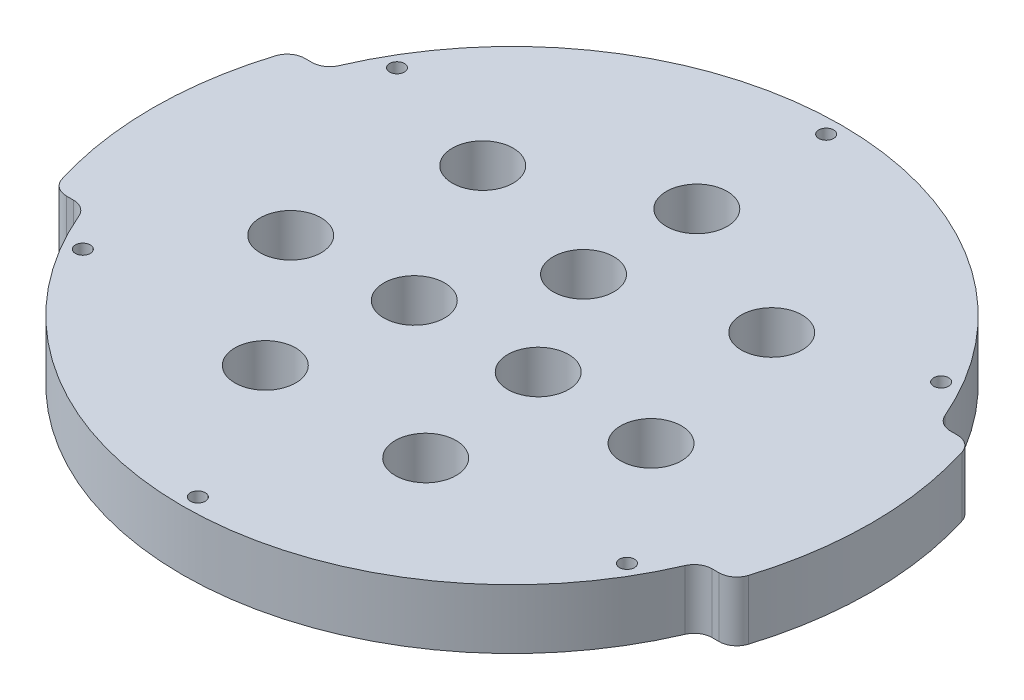
ISO-10303-21;
HEADER;
FILE_DESCRIPTION(('STEP AP214'),'2;1');
FILE_NAME('part.step','',(''),(''),'','','');
FILE_SCHEMA(('AUTOMOTIVE_DESIGN { 1 0 10303 214 1 1 1 1 }'));
ENDSEC;
DATA;
#1=APPLICATION_CONTEXT('core data for automotive mechanical design processes');
#2=APPLICATION_PROTOCOL_DEFINITION('international standard','automotive_design',2000,#1);
#3=PRODUCT_CONTEXT('',#1,'mechanical');
#4=PRODUCT('Part','Part','',(#3));
#5=PRODUCT_RELATED_PRODUCT_CATEGORY('part','',(#4));
#6=PRODUCT_DEFINITION_FORMATION('','',#4);
#7=PRODUCT_DEFINITION_CONTEXT('part definition',#1,'design');
#8=PRODUCT_DEFINITION('design','',#6,#7);
#9=PRODUCT_DEFINITION_SHAPE('','',#8);
#10=(LENGTH_UNIT() NAMED_UNIT(*) SI_UNIT(.MILLI.,.METRE.));
#11=(NAMED_UNIT(*) PLANE_ANGLE_UNIT() SI_UNIT($,.RADIAN.));
#12=(NAMED_UNIT(*) SI_UNIT($,.STERADIAN.) SOLID_ANGLE_UNIT());
#13=UNCERTAINTY_MEASURE_WITH_UNIT(LENGTH_MEASURE(1.E-05),#10,'distance_accuracy_value','');
#14=(GEOMETRIC_REPRESENTATION_CONTEXT(3) GLOBAL_UNCERTAINTY_ASSIGNED_CONTEXT((#13)) GLOBAL_UNIT_ASSIGNED_CONTEXT((#10,
#11,#12)) REPRESENTATION_CONTEXT('',''));
#15=CARTESIAN_POINT('',(0.,0.,0.));
#16=DIRECTION('',(0.,0.,1.));
#17=DIRECTION('',(1.,0.,0.));
#18=AXIS2_PLACEMENT_3D('',#15,#16,#17);
#19=CARTESIAN_POINT('',(0.,10.,0.));
#20=DIRECTION('',(0.,-1.,0.));
#21=DIRECTION('',(0.,0.,-1.));
#22=AXIS2_PLACEMENT_3D('',#19,#20,#21);
#23=CYLINDRICAL_SURFACE('',#22,60.3);
#24=CARTESIAN_POINT('',(0.,0.,0.));
#25=DIRECTION('',(0.,1.,0.));
#26=DIRECTION('',(0.,0.,1.));
#27=AXIS2_PLACEMENT_3D('',#24,#25,#26);
#28=CIRCLE('',#27,60.3);
#29=CARTESIAN_POINT('',(57.5850330094447,0.,17.8900523560209));
#30=VERTEX_POINT('',#29);
#31=CARTESIAN_POINT('',(57.5850330094447,0.,-17.8900523560209));
#32=VERTEX_POINT('',#31);
#33=EDGE_CURVE('E189',#30,#32,#28,.T.);
#34=ORIENTED_EDGE('',*,*,#33,.T.);
#35=DIRECTION('',(0.,-1.,0.));
#36=VECTOR('',#35,1.);
#37=CARTESIAN_POINT('',(57.5850330094447,10.,-17.8900523560209));
#38=LINE('',#37,#36);
#39=CARTESIAN_POINT('',(57.5850330094447,10.,-17.8900523560209));
#40=VERTEX_POINT('',#39);
#41=EDGE_CURVE('E196',#32,#40,#38,.F.);
#42=ORIENTED_EDGE('',*,*,#41,.T.);
#43=CARTESIAN_POINT('',(0.,10.,0.));
#44=DIRECTION('',(0.,1.,0.));
#45=DIRECTION('',(0.,0.,1.));
#46=AXIS2_PLACEMENT_3D('',#43,#44,#45);
#47=CIRCLE('',#46,60.3);
#48=CARTESIAN_POINT('',(57.5850330094447,10.,17.8900523560209));
#49=VERTEX_POINT('',#48);
#50=EDGE_CURVE('E185',#49,#40,#47,.T.);
#51=ORIENTED_EDGE('',*,*,#50,.F.);
#52=DIRECTION('',(0.,-1.,0.));
#53=VECTOR('',#52,1.);
#54=CARTESIAN_POINT('',(57.5850330094447,10.,17.8900523560209));
#55=LINE('',#54,#53);
#56=EDGE_CURVE('E194',#49,#30,#55,.T.);
#57=ORIENTED_EDGE('',*,*,#56,.T.);
#58=EDGE_LOOP('',(#34,#42,#51,#57));
#59=FACE_BOUND('',#58,.T.);
#60=ADVANCED_FACE('F32',(#59),#23,.T.);
#61=CARTESIAN_POINT('',(-57.5850330094447,0.,-17.8900523560209));
#62=VERTEX_POINT('',#61);
#63=CARTESIAN_POINT('',(-57.5850330094446,0.,17.890052356021));
#64=VERTEX_POINT('',#63);
#65=EDGE_CURVE('E186',#62,#64,#28,.T.);
#66=ORIENTED_EDGE('',*,*,#65,.T.);
#67=DIRECTION('',(0.,-1.,0.));
#68=VECTOR('',#67,1.);
#69=CARTESIAN_POINT('',(-57.5850330094447,10.,17.890052356021));
#70=LINE('',#69,#68);
#71=CARTESIAN_POINT('',(-57.5850330094446,10.,17.890052356021));
#72=VERTEX_POINT('',#71);
#73=EDGE_CURVE('E230',#64,#72,#70,.F.);
#74=ORIENTED_EDGE('',*,*,#73,.T.);
#75=CARTESIAN_POINT('',(-57.5850330094447,10.,-17.8900523560209));
#76=VERTEX_POINT('',#75);
#77=EDGE_CURVE('E182',#76,#72,#47,.T.);
#78=ORIENTED_EDGE('',*,*,#77,.F.);
#79=DIRECTION('',(0.,-1.,0.));
#80=VECTOR('',#79,1.);
#81=CARTESIAN_POINT('',(-57.5850330094447,10.,-17.8900523560209));
#82=LINE('',#81,#80);
#83=EDGE_CURVE('E228',#76,#62,#82,.T.);
#84=ORIENTED_EDGE('',*,*,#83,.T.);
#85=EDGE_LOOP('',(#66,#74,#78,#84));
#86=FACE_BOUND('',#85,.T.);
#87=ADVANCED_FACE('F284',(#86),#23,.T.);
#88=CARTESIAN_POINT('',(0.,10.,0.));
#89=DIRECTION('',(0.,1.,0.));
#90=DIRECTION('',(0.,0.,1.));
#91=AXIS2_PLACEMENT_3D('',#88,#89,#90);
#92=PLANE('',#91);
#93=CARTESIAN_POINT('',(-10.3923048454128,10.,6.0000000000003));
#94=DIRECTION('',(0.,1.,0.));
#95=DIRECTION('',(0.,0.,1.));
#96=AXIS2_PLACEMENT_3D('',#93,#94,#95);
#97=CIRCLE('',#96,5.10000000000068);
#98=CARTESIAN_POINT('',(-10.3923048454128,10.,11.100000000001));
#99=VERTEX_POINT('',#98);
#100=EDGE_CURVE('E385',#99,#99,#97,.T.);
#101=ORIENTED_EDGE('',*,*,#100,.F.);
#102=EDGE_LOOP('',(#101));
#103=FACE_BOUND('',#102,.T.);
#104=CARTESIAN_POINT('',(10.3923048454138,10.,5.9999999999997));
#105=DIRECTION('',(0.,1.,0.));
#106=DIRECTION('',(0.,0.,1.));
#107=AXIS2_PLACEMENT_3D('',#104,#105,#106);
#108=CIRCLE('',#107,5.10000000000047);
#109=CARTESIAN_POINT('',(10.3923048454138,10.,11.1000000000002));
#110=VERTEX_POINT('',#109);
#111=EDGE_CURVE('E387',#110,#110,#108,.T.);
#112=ORIENTED_EDGE('',*,*,#111,.F.);
#113=EDGE_LOOP('',(#112));
#114=FACE_BOUND('',#113,.T.);
#115=CARTESIAN_POINT('',(0.,10.,-12.));
#116=DIRECTION('',(0.,1.,0.));
#117=DIRECTION('',(0.,0.,1.));
#118=AXIS2_PLACEMENT_3D('',#115,#116,#117);
#119=CIRCLE('',#118,5.1);
#120=CARTESIAN_POINT('',(0.,10.,-6.9));
#121=VERTEX_POINT('',#120);
#122=EDGE_CURVE('E393',#121,#121,#119,.T.);
#123=ORIENTED_EDGE('',*,*,#122,.F.);
#124=EDGE_LOOP('',(#123));
#125=FACE_BOUND('',#124,.T.);
#126=CARTESIAN_POINT('',(-24.2367759565083,10.,-19.3281838576194));
#127=DIRECTION('',(0.,1.,0.));
#128=DIRECTION('',(0.,0.,1.));
#129=AXIS2_PLACEMENT_3D('',#126,#127,#128);
#130=CIRCLE('',#129,5.10000000000141);
#131=CARTESIAN_POINT('',(-24.2367759565083,10.,-14.228183857618));
#132=VERTEX_POINT('',#131);
#133=EDGE_CURVE('E399',#132,#132,#130,.T.);
#134=ORIENTED_EDGE('',*,*,#133,.F.);
#135=EDGE_LOOP('',(#134));
#136=FACE_BOUND('',#135,.T.);
#137=CARTESIAN_POINT('',(-30.2227652776344,10.,6.89814895264746));
#138=DIRECTION('',(0.,1.,0.));
#139=DIRECTION('',(0.,0.,1.));
#140=AXIS2_PLACEMENT_3D('',#137,#138,#139);
#141=CIRCLE('',#140,5.10000000000284);
#142=CARTESIAN_POINT('',(-30.2227652776344,10.,11.9981489526503));
#143=VERTEX_POINT('',#142);
#144=EDGE_CURVE('E405',#143,#143,#141,.T.);
#145=ORIENTED_EDGE('',*,*,#144,.F.);
#146=EDGE_LOOP('',(#145));
#147=FACE_BOUND('',#146,.T.);
#148=CARTESIAN_POINT('',(-13.450395912641,10.,27.9300349049758));
#149=DIRECTION('',(0.,1.,0.));
#150=DIRECTION('',(0.,0.,1.));
#151=AXIS2_PLACEMENT_3D('',#148,#149,#150);
#152=CIRCLE('',#151,5.10000000000365);
#153=CARTESIAN_POINT('',(-13.450395912641,10.,33.0300349049794));
#154=VERTEX_POINT('',#153);
#155=EDGE_CURVE('E411',#154,#154,#152,.T.);
#156=ORIENTED_EDGE('',*,*,#155,.F.);
#157=EDGE_LOOP('',(#156));
#158=FACE_BOUND('',#157,.T.);
#159=CARTESIAN_POINT('',(13.4503959126476,10.,27.9300349049742));
#160=DIRECTION('',(0.,1.,0.));
#161=DIRECTION('',(0.,0.,1.));
#162=AXIS2_PLACEMENT_3D('',#159,#160,#161);
#163=CIRCLE('',#162,5.10000000000316);
#164=CARTESIAN_POINT('',(13.4503959126476,10.,33.0300349049774));
#165=VERTEX_POINT('',#164);
#166=EDGE_CURVE('E417',#165,#165,#163,.T.);
#167=ORIENTED_EDGE('',*,*,#166,.F.);
#168=EDGE_LOOP('',(#167));
#169=FACE_BOUND('',#168,.T.);
#170=CARTESIAN_POINT('',(30.2227652776387,10.,6.89814895264403));
#171=DIRECTION('',(0.,1.,0.));
#172=DIRECTION('',(0.,0.,1.));
#173=AXIS2_PLACEMENT_3D('',#170,#171,#172);
#174=CIRCLE('',#173,5.10000000000167);
#175=CARTESIAN_POINT('',(30.2227652776387,10.,11.9981489526457));
#176=VERTEX_POINT('',#175);
#177=EDGE_CURVE('E423',#176,#176,#174,.T.);
#178=ORIENTED_EDGE('',*,*,#177,.F.);
#179=EDGE_LOOP('',(#178));
#180=FACE_BOUND('',#179,.T.);
#181=CARTESIAN_POINT('',(24.2367759565096,10.,-19.3281838576221));
#182=DIRECTION('',(0.,1.,0.));
#183=DIRECTION('',(0.,0.,1.));
#184=AXIS2_PLACEMENT_3D('',#181,#182,#183);
#185=CIRCLE('',#184,5.10000000000029);
#186=CARTESIAN_POINT('',(24.2367759565096,10.,-14.2281838576218));
#187=VERTEX_POINT('',#186);
#188=EDGE_CURVE('E429',#187,#187,#185,.T.);
#189=ORIENTED_EDGE('',*,*,#188,.F.);
#190=EDGE_LOOP('',(#189));
#191=FACE_BOUND('',#190,.T.);
#192=CARTESIAN_POINT('',(0.,10.,-31.));
#193=DIRECTION('',(0.,1.,0.));
#194=DIRECTION('',(0.,0.,1.));
#195=AXIS2_PLACEMENT_3D('',#192,#193,#194);
#196=CIRCLE('',#195,5.1);
#197=CARTESIAN_POINT('',(0.,10.,-25.9));
#198=VERTEX_POINT('',#197);
#199=EDGE_CURVE('E435',#198,#198,#196,.T.);
#200=ORIENTED_EDGE('',*,*,#199,.F.);
#201=EDGE_LOOP('',(#200));
#202=FACE_BOUND('',#201,.T.);
#203=CARTESIAN_POINT('',(45.6395387794396,10.,-26.3500000000005));
#204=DIRECTION('',(0.,-1.,0.));
#205=DIRECTION('',(0.,0.,-1.));
#206=AXIS2_PLACEMENT_3D('',#203,#204,#205);
#207=CIRCLE('',#206,1.25);
#208=CARTESIAN_POINT('',(45.6395387794396,10.,-27.6000000000005));
#209=VERTEX_POINT('',#208);
#210=EDGE_CURVE('E444',#209,#209,#207,.T.);
#211=ORIENTED_EDGE('',*,*,#210,.T.);
#212=EDGE_LOOP('',(#211));
#213=FACE_BOUND('',#212,.T.);
#214=CARTESIAN_POINT('',(45.6395387794402,10.,26.3499999999996));
#215=DIRECTION('',(0.,-1.,0.));
#216=DIRECTION('',(0.,0.,-1.));
#217=AXIS2_PLACEMENT_3D('',#214,#215,#216);
#218=CIRCLE('',#217,1.25);
#219=CARTESIAN_POINT('',(45.6395387794402,10.,25.0999999999996));
#220=VERTEX_POINT('',#219);
#221=EDGE_CURVE('E450',#220,#220,#218,.T.);
#222=ORIENTED_EDGE('',*,*,#221,.T.);
#223=EDGE_LOOP('',(#222));
#224=FACE_BOUND('',#223,.T.);
#225=CARTESIAN_POINT('',(3.68002133114066E-13,10.,52.7));
#226=DIRECTION('',(0.,-1.,0.));
#227=DIRECTION('',(0.,0.,-1.));
#228=AXIS2_PLACEMENT_3D('',#225,#226,#227);
#229=CIRCLE('',#228,1.25);
#230=CARTESIAN_POINT('',(3.68002133114066E-13,10.,51.45));
#231=VERTEX_POINT('',#230);
#232=EDGE_CURVE('E456',#231,#231,#229,.T.);
#233=ORIENTED_EDGE('',*,*,#232,.T.);
#234=EDGE_LOOP('',(#233));
#235=FACE_BOUND('',#234,.T.);
#236=CARTESIAN_POINT('',(-45.6395387794398,10.,26.3500000000002));
#237=DIRECTION('',(0.,-1.,0.));
#238=DIRECTION('',(0.,0.,-1.));
#239=AXIS2_PLACEMENT_3D('',#236,#237,#238);
#240=CIRCLE('',#239,1.25);
#241=CARTESIAN_POINT('',(-45.6395387794398,10.,25.1000000000002));
#242=VERTEX_POINT('',#241);
#243=EDGE_CURVE('E462',#242,#242,#240,.T.);
#244=ORIENTED_EDGE('',*,*,#243,.T.);
#245=EDGE_LOOP('',(#244));
#246=FACE_BOUND('',#245,.T.);
#247=CARTESIAN_POINT('',(-45.63953877944,10.,-26.3499999999999));
#248=DIRECTION('',(0.,-1.,0.));
#249=DIRECTION('',(0.,0.,-1.));
#250=AXIS2_PLACEMENT_3D('',#247,#248,#249);
#251=CIRCLE('',#250,1.25);
#252=CARTESIAN_POINT('',(-45.63953877944,10.,-27.5999999999999));
#253=VERTEX_POINT('',#252);
#254=EDGE_CURVE('E468',#253,#253,#251,.T.);
#255=ORIENTED_EDGE('',*,*,#254,.T.);
#256=EDGE_LOOP('',(#255));
#257=FACE_BOUND('',#256,.T.);
#258=CARTESIAN_POINT('',(0.,10.,-52.7));
#259=DIRECTION('',(0.,-1.,0.));
#260=DIRECTION('',(0.,0.,-1.));
#261=AXIS2_PLACEMENT_3D('',#258,#259,#260);
#262=CIRCLE('',#261,1.25);
#263=CARTESIAN_POINT('',(0.,10.,-53.95));
#264=VERTEX_POINT('',#263);
#265=EDGE_CURVE('E474',#264,#264,#262,.T.);
#266=ORIENTED_EDGE('',*,*,#265,.T.);
#267=EDGE_LOOP('',(#266));
#268=FACE_BOUND('',#267,.T.);
#269=ORIENTED_EDGE('',*,*,#50,.T.);
#270=CARTESIAN_POINT('',(54.7201059940494,10.,-17.));
#271=DIRECTION('',(0.,1.,0.));
#272=DIRECTION('',(0.,0.,1.));
#273=AXIS2_PLACEMENT_3D('',#270,#271,#272);
#274=CIRCLE('',#273,3.);
#275=CARTESIAN_POINT('',(54.7201059940494,10.,-20.));
#276=VERTEX_POINT('',#275);
#277=EDGE_CURVE('E172',#40,#276,#274,.T.);
#278=ORIENTED_EDGE('',*,*,#277,.T.);
#279=DIRECTION('',(1.,0.,0.));
#280=VECTOR('',#279,1.);
#281=CARTESIAN_POINT('',(51.5566678519859,10.,-20.));
#282=LINE('',#281,#280);
#283=CARTESIAN_POINT('',(53.5713542856628,10.,-20.));
#284=VERTEX_POINT('',#283);
#285=EDGE_CURVE('E163',#284,#276,#282,.T.);
#286=ORIENTED_EDGE('',*,*,#285,.F.);
#287=CARTESIAN_POINT('',(53.5713542856628,10.,-23.));
#288=DIRECTION('',(0.,1.,0.));
#289=DIRECTION('',(0.,0.,1.));
#290=AXIS2_PLACEMENT_3D('',#287,#288,#289);
#291=CIRCLE('',#290,3.);
#292=CARTESIAN_POINT('',(50.8146808232788,10.,-21.8164665523156));
#293=VERTEX_POINT('',#292);
#294=EDGE_CURVE('E146',#284,#293,#291,.F.);
#295=ORIENTED_EDGE('',*,*,#294,.T.);
#296=CARTESIAN_POINT('',(0.,10.,0.));
#297=DIRECTION('',(0.,-1.,0.));
#298=DIRECTION('',(0.,0.,1.));
#299=AXIS2_PLACEMENT_3D('',#296,#297,#298);
#300=CIRCLE('',#299,55.3);
#301=CARTESIAN_POINT('',(-50.8146808232788,10.,-21.8164665523156));
#302=VERTEX_POINT('',#301);
#303=EDGE_CURVE('E174',#302,#293,#300,.T.);
#304=ORIENTED_EDGE('',*,*,#303,.F.);
#305=CARTESIAN_POINT('',(-53.5713542856628,10.,-23.));
#306=DIRECTION('',(0.,1.,0.));
#307=DIRECTION('',(0.,0.,1.));
#308=AXIS2_PLACEMENT_3D('',#305,#306,#307);
#309=CIRCLE('',#308,3.);
#310=CARTESIAN_POINT('',(-53.5713542856628,10.,-20.));
#311=VERTEX_POINT('',#310);
#312=EDGE_CURVE('E40',#302,#311,#309,.F.);
#313=ORIENTED_EDGE('',*,*,#312,.T.);
#314=DIRECTION('',(1.,0.,0.));
#315=VECTOR('',#314,1.);
#316=CARTESIAN_POINT('',(-51.5566678519859,10.,-20.));
#317=LINE('',#316,#315);
#318=CARTESIAN_POINT('',(-54.7201059940494,10.,-20.));
#319=VERTEX_POINT('',#318);
#320=EDGE_CURVE('E173',#319,#311,#317,.T.);
#321=ORIENTED_EDGE('',*,*,#320,.F.);
#322=CARTESIAN_POINT('',(-54.7201059940494,10.,-17.));
#323=DIRECTION('',(0.,1.,0.));
#324=DIRECTION('',(0.,0.,1.));
#325=AXIS2_PLACEMENT_3D('',#322,#323,#324);
#326=CIRCLE('',#325,3.);
#327=EDGE_CURVE('E199',#319,#76,#326,.T.);
#328=ORIENTED_EDGE('',*,*,#327,.T.);
#329=ORIENTED_EDGE('',*,*,#77,.T.);
#330=CARTESIAN_POINT('',(-54.7201059940494,10.,17.));
#331=DIRECTION('',(0.,1.,0.));
#332=DIRECTION('',(0.,0.,1.));
#333=AXIS2_PLACEMENT_3D('',#330,#331,#332);
#334=CIRCLE('',#333,3.);
#335=CARTESIAN_POINT('',(-54.7201059940494,10.,20.));
#336=VERTEX_POINT('',#335);
#337=EDGE_CURVE('E201',#72,#336,#334,.T.);
#338=ORIENTED_EDGE('',*,*,#337,.T.);
#339=DIRECTION('',(-1.,0.,0.));
#340=VECTOR('',#339,1.);
#341=CARTESIAN_POINT('',(-56.8866416656846,10.,20.));
#342=LINE('',#341,#340);
#343=CARTESIAN_POINT('',(-53.5713542856628,10.,20.));
#344=VERTEX_POINT('',#343);
#345=EDGE_CURVE('E489',#344,#336,#342,.T.);
#346=ORIENTED_EDGE('',*,*,#345,.F.);
#347=CARTESIAN_POINT('',(-53.5713542856628,10.,23.));
#348=DIRECTION('',(0.,1.,0.));
#349=DIRECTION('',(0.,0.,1.));
#350=AXIS2_PLACEMENT_3D('',#347,#348,#349);
#351=CIRCLE('',#350,3.);
#352=CARTESIAN_POINT('',(-50.8146808232787,10.,21.8164665523156));
#353=VERTEX_POINT('',#352);
#354=EDGE_CURVE('E241',#344,#353,#351,.F.);
#355=ORIENTED_EDGE('',*,*,#354,.T.);
#356=CARTESIAN_POINT('',(0.,10.,0.));
#357=DIRECTION('',(0.,-1.,0.));
#358=DIRECTION('',(0.,0.,1.));
#359=AXIS2_PLACEMENT_3D('',#356,#357,#358);
#360=CIRCLE('',#359,55.3);
#361=CARTESIAN_POINT('',(50.8146808232787,10.,21.8164665523156));
#362=VERTEX_POINT('',#361);
#363=EDGE_CURVE('E477',#362,#353,#360,.T.);
#364=ORIENTED_EDGE('',*,*,#363,.F.);
#365=CARTESIAN_POINT('',(53.5713542856628,10.,23.));
#366=DIRECTION('',(0.,1.,0.));
#367=DIRECTION('',(0.,0.,1.));
#368=AXIS2_PLACEMENT_3D('',#365,#366,#367);
#369=CIRCLE('',#368,3.);
#370=CARTESIAN_POINT('',(53.5713542856628,10.,20.));
#371=VERTEX_POINT('',#370);
#372=EDGE_CURVE('E237',#362,#371,#369,.F.);
#373=ORIENTED_EDGE('',*,*,#372,.T.);
#374=DIRECTION('',(-1.,0.,0.));
#375=VECTOR('',#374,1.);
#376=CARTESIAN_POINT('',(51.5566678519859,10.,20.));
#377=LINE('',#376,#375);
#378=CARTESIAN_POINT('',(54.7201059940494,10.,20.));
#379=VERTEX_POINT('',#378);
#380=EDGE_CURVE('E259',#379,#371,#377,.T.);
#381=ORIENTED_EDGE('',*,*,#380,.F.);
#382=CARTESIAN_POINT('',(54.7201059940494,10.,17.));
#383=DIRECTION('',(0.,1.,0.));
#384=DIRECTION('',(0.,0.,1.));
#385=AXIS2_PLACEMENT_3D('',#382,#383,#384);
#386=CIRCLE('',#385,3.);
#387=EDGE_CURVE('E203',#379,#49,#386,.T.);
#388=ORIENTED_EDGE('',*,*,#387,.T.);
#389=EDGE_LOOP('',(#269,#278,#286,#295,#304,#313,#321,#328,#329,#338,#346,#355,#364,#373,#381,#388));
#390=FACE_BOUND('',#389,.T.);
#391=ADVANCED_FACE('F171',(#103,#114,#125,#136,#147,#158,#169,#180,#191,#202,#213,#224,#235,
#246,#257,#268,#390),#92,.T.);
#392=CARTESIAN_POINT('',(0.,0.,0.));
#393=DIRECTION('',(0.,1.,0.));
#394=DIRECTION('',(0.,0.,1.));
#395=AXIS2_PLACEMENT_3D('',#392,#393,#394);
#396=PLANE('',#395);
#397=CARTESIAN_POINT('',(-10.3923048454128,0.,6.0000000000003));
#398=DIRECTION('',(0.,1.,0.));
#399=DIRECTION('',(0.,0.,1.));
#400=AXIS2_PLACEMENT_3D('',#397,#398,#399);
#401=CIRCLE('',#400,5.10000000000068);
#402=CARTESIAN_POINT('',(-10.3923048454128,0.,11.100000000001));
#403=VERTEX_POINT('',#402);
#404=EDGE_CURVE('E382',#403,#403,#401,.T.);
#405=ORIENTED_EDGE('',*,*,#404,.T.);
#406=EDGE_LOOP('',(#405));
#407=FACE_BOUND('',#406,.T.);
#408=CARTESIAN_POINT('',(10.3923048454138,0.,5.9999999999997));
#409=DIRECTION('',(0.,1.,0.));
#410=DIRECTION('',(0.,0.,1.));
#411=AXIS2_PLACEMENT_3D('',#408,#409,#410);
#412=CIRCLE('',#411,5.10000000000047);
#413=CARTESIAN_POINT('',(10.3923048454138,0.,11.1000000000002));
#414=VERTEX_POINT('',#413);
#415=EDGE_CURVE('E390',#414,#414,#412,.T.);
#416=ORIENTED_EDGE('',*,*,#415,.T.);
#417=EDGE_LOOP('',(#416));
#418=FACE_BOUND('',#417,.T.);
#419=CARTESIAN_POINT('',(0.,0.,-12.));
#420=DIRECTION('',(0.,1.,0.));
#421=DIRECTION('',(0.,0.,1.));
#422=AXIS2_PLACEMENT_3D('',#419,#420,#421);
#423=CIRCLE('',#422,5.1);
#424=CARTESIAN_POINT('',(0.,0.,-6.9));
#425=VERTEX_POINT('',#424);
#426=EDGE_CURVE('E396',#425,#425,#423,.T.);
#427=ORIENTED_EDGE('',*,*,#426,.T.);
#428=EDGE_LOOP('',(#427));
#429=FACE_BOUND('',#428,.T.);
#430=CARTESIAN_POINT('',(-24.2367759565083,0.,-19.3281838576194));
#431=DIRECTION('',(0.,1.,0.));
#432=DIRECTION('',(0.,0.,1.));
#433=AXIS2_PLACEMENT_3D('',#430,#431,#432);
#434=CIRCLE('',#433,5.10000000000141);
#435=CARTESIAN_POINT('',(-24.2367759565083,0.,-14.228183857618));
#436=VERTEX_POINT('',#435);
#437=EDGE_CURVE('E402',#436,#436,#434,.T.);
#438=ORIENTED_EDGE('',*,*,#437,.T.);
#439=EDGE_LOOP('',(#438));
#440=FACE_BOUND('',#439,.T.);
#441=CARTESIAN_POINT('',(-30.2227652776344,0.,6.89814895264746));
#442=DIRECTION('',(0.,1.,0.));
#443=DIRECTION('',(0.,0.,1.));
#444=AXIS2_PLACEMENT_3D('',#441,#442,#443);
#445=CIRCLE('',#444,5.10000000000284);
#446=CARTESIAN_POINT('',(-30.2227652776344,0.,11.9981489526503));
#447=VERTEX_POINT('',#446);
#448=EDGE_CURVE('E408',#447,#447,#445,.T.);
#449=ORIENTED_EDGE('',*,*,#448,.T.);
#450=EDGE_LOOP('',(#449));
#451=FACE_BOUND('',#450,.T.);
#452=CARTESIAN_POINT('',(-13.450395912641,0.,27.9300349049758));
#453=DIRECTION('',(0.,1.,0.));
#454=DIRECTION('',(0.,0.,1.));
#455=AXIS2_PLACEMENT_3D('',#452,#453,#454);
#456=CIRCLE('',#455,5.10000000000365);
#457=CARTESIAN_POINT('',(-13.450395912641,0.,33.0300349049794));
#458=VERTEX_POINT('',#457);
#459=EDGE_CURVE('E414',#458,#458,#456,.T.);
#460=ORIENTED_EDGE('',*,*,#459,.T.);
#461=EDGE_LOOP('',(#460));
#462=FACE_BOUND('',#461,.T.);
#463=CARTESIAN_POINT('',(13.4503959126476,0.,27.9300349049742));
#464=DIRECTION('',(0.,1.,0.));
#465=DIRECTION('',(0.,0.,1.));
#466=AXIS2_PLACEMENT_3D('',#463,#464,#465);
#467=CIRCLE('',#466,5.10000000000316);
#468=CARTESIAN_POINT('',(13.4503959126476,0.,33.0300349049774));
#469=VERTEX_POINT('',#468);
#470=EDGE_CURVE('E420',#469,#469,#467,.T.);
#471=ORIENTED_EDGE('',*,*,#470,.T.);
#472=EDGE_LOOP('',(#471));
#473=FACE_BOUND('',#472,.T.);
#474=CARTESIAN_POINT('',(30.2227652776387,0.,6.89814895264403));
#475=DIRECTION('',(0.,1.,0.));
#476=DIRECTION('',(0.,0.,1.));
#477=AXIS2_PLACEMENT_3D('',#474,#475,#476);
#478=CIRCLE('',#477,5.10000000000167);
#479=CARTESIAN_POINT('',(30.2227652776387,0.,11.9981489526457));
#480=VERTEX_POINT('',#479);
#481=EDGE_CURVE('E426',#480,#480,#478,.T.);
#482=ORIENTED_EDGE('',*,*,#481,.T.);
#483=EDGE_LOOP('',(#482));
#484=FACE_BOUND('',#483,.T.);
#485=CARTESIAN_POINT('',(24.2367759565096,0.,-19.3281838576221));
#486=DIRECTION('',(0.,1.,0.));
#487=DIRECTION('',(0.,0.,1.));
#488=AXIS2_PLACEMENT_3D('',#485,#486,#487);
#489=CIRCLE('',#488,5.10000000000029);
#490=CARTESIAN_POINT('',(24.2367759565096,0.,-14.2281838576218));
#491=VERTEX_POINT('',#490);
#492=EDGE_CURVE('E432',#491,#491,#489,.T.);
#493=ORIENTED_EDGE('',*,*,#492,.T.);
#494=EDGE_LOOP('',(#493));
#495=FACE_BOUND('',#494,.T.);
#496=CARTESIAN_POINT('',(0.,0.,-31.));
#497=DIRECTION('',(0.,1.,0.));
#498=DIRECTION('',(0.,0.,1.));
#499=AXIS2_PLACEMENT_3D('',#496,#497,#498);
#500=CIRCLE('',#499,5.1);
#501=CARTESIAN_POINT('',(0.,0.,-25.9));
#502=VERTEX_POINT('',#501);
#503=EDGE_CURVE('E438',#502,#502,#500,.T.);
#504=ORIENTED_EDGE('',*,*,#503,.T.);
#505=EDGE_LOOP('',(#504));
#506=FACE_BOUND('',#505,.T.);
#507=CARTESIAN_POINT('',(45.6395387794396,0.,-26.3500000000005));
#508=DIRECTION('',(0.,-1.,0.));
#509=DIRECTION('',(0.,0.,-1.));
#510=AXIS2_PLACEMENT_3D('',#507,#508,#509);
#511=CIRCLE('',#510,1.25);
#512=CARTESIAN_POINT('',(45.6395387794396,0.,-27.6000000000005));
#513=VERTEX_POINT('',#512);
#514=EDGE_CURVE('E441',#513,#513,#511,.T.);
#515=ORIENTED_EDGE('',*,*,#514,.F.);
#516=EDGE_LOOP('',(#515));
#517=FACE_BOUND('',#516,.T.);
#518=CARTESIAN_POINT('',(45.6395387794402,0.,26.3499999999996));
#519=DIRECTION('',(0.,-1.,0.));
#520=DIRECTION('',(0.,0.,-1.));
#521=AXIS2_PLACEMENT_3D('',#518,#519,#520);
#522=CIRCLE('',#521,1.25);
#523=CARTESIAN_POINT('',(45.6395387794402,0.,25.0999999999996));
#524=VERTEX_POINT('',#523);
#525=EDGE_CURVE('E447',#524,#524,#522,.T.);
#526=ORIENTED_EDGE('',*,*,#525,.F.);
#527=EDGE_LOOP('',(#526));
#528=FACE_BOUND('',#527,.T.);
#529=CARTESIAN_POINT('',(3.68002133114066E-13,0.,52.7));
#530=DIRECTION('',(0.,-1.,0.));
#531=DIRECTION('',(0.,0.,-1.));
#532=AXIS2_PLACEMENT_3D('',#529,#530,#531);
#533=CIRCLE('',#532,1.25);
#534=CARTESIAN_POINT('',(3.68002133114066E-13,0.,51.45));
#535=VERTEX_POINT('',#534);
#536=EDGE_CURVE('E453',#535,#535,#533,.T.);
#537=ORIENTED_EDGE('',*,*,#536,.F.);
#538=EDGE_LOOP('',(#537));
#539=FACE_BOUND('',#538,.T.);
#540=CARTESIAN_POINT('',(-45.6395387794398,0.,26.3500000000002));
#541=DIRECTION('',(0.,-1.,0.));
#542=DIRECTION('',(0.,0.,-1.));
#543=AXIS2_PLACEMENT_3D('',#540,#541,#542);
#544=CIRCLE('',#543,1.25);
#545=CARTESIAN_POINT('',(-45.6395387794398,0.,25.1000000000002));
#546=VERTEX_POINT('',#545);
#547=EDGE_CURVE('E459',#546,#546,#544,.T.);
#548=ORIENTED_EDGE('',*,*,#547,.F.);
#549=EDGE_LOOP('',(#548));
#550=FACE_BOUND('',#549,.T.);
#551=CARTESIAN_POINT('',(-45.63953877944,0.,-26.3499999999999));
#552=DIRECTION('',(0.,-1.,0.));
#553=DIRECTION('',(0.,0.,-1.));
#554=AXIS2_PLACEMENT_3D('',#551,#552,#553);
#555=CIRCLE('',#554,1.25);
#556=CARTESIAN_POINT('',(-45.63953877944,0.,-27.5999999999999));
#557=VERTEX_POINT('',#556);
#558=EDGE_CURVE('E465',#557,#557,#555,.T.);
#559=ORIENTED_EDGE('',*,*,#558,.F.);
#560=EDGE_LOOP('',(#559));
#561=FACE_BOUND('',#560,.T.);
#562=CARTESIAN_POINT('',(0.,0.,-52.7));
#563=DIRECTION('',(0.,-1.,0.));
#564=DIRECTION('',(0.,0.,-1.));
#565=AXIS2_PLACEMENT_3D('',#562,#563,#564);
#566=CIRCLE('',#565,1.25);
#567=CARTESIAN_POINT('',(0.,0.,-53.95));
#568=VERTEX_POINT('',#567);
#569=EDGE_CURVE('E471',#568,#568,#566,.T.);
#570=ORIENTED_EDGE('',*,*,#569,.F.);
#571=EDGE_LOOP('',(#570));
#572=FACE_BOUND('',#571,.T.);
#573=DIRECTION('',(1.,0.,0.));
#574=VECTOR('',#573,1.);
#575=CARTESIAN_POINT('',(51.5566678519859,0.,-20.));
#576=LINE('',#575,#574);
#577=CARTESIAN_POINT('',(53.5713542856628,0.,-20.));
#578=VERTEX_POINT('',#577);
#579=CARTESIAN_POINT('',(54.7201059940494,0.,-20.));
#580=VERTEX_POINT('',#579);
#581=EDGE_CURVE('E166',#578,#580,#576,.T.);
#582=ORIENTED_EDGE('',*,*,#581,.T.);
#583=CARTESIAN_POINT('',(54.7201059940494,0.,-17.));
#584=DIRECTION('',(0.,1.,0.));
#585=DIRECTION('',(0.,0.,1.));
#586=AXIS2_PLACEMENT_3D('',#583,#584,#585);
#587=CIRCLE('',#586,3.);
#588=EDGE_CURVE('E211',#580,#32,#587,.F.);
#589=ORIENTED_EDGE('',*,*,#588,.T.);
#590=ORIENTED_EDGE('',*,*,#33,.F.);
#591=CARTESIAN_POINT('',(54.7201059940494,0.,17.));
#592=DIRECTION('',(0.,1.,0.));
#593=DIRECTION('',(0.,0.,1.));
#594=AXIS2_PLACEMENT_3D('',#591,#592,#593);
#595=CIRCLE('',#594,3.);
#596=CARTESIAN_POINT('',(54.7201059940494,0.,20.));
#597=VERTEX_POINT('',#596);
#598=EDGE_CURVE('E209',#30,#597,#595,.F.);
#599=ORIENTED_EDGE('',*,*,#598,.T.);
#600=DIRECTION('',(-1.,0.,0.));
#601=VECTOR('',#600,1.);
#602=CARTESIAN_POINT('',(51.5566678519859,0.,20.));
#603=LINE('',#602,#601);
#604=CARTESIAN_POINT('',(53.5713542856628,0.,20.));
#605=VERTEX_POINT('',#604);
#606=EDGE_CURVE('E178',#597,#605,#603,.T.);
#607=ORIENTED_EDGE('',*,*,#606,.T.);
#608=CARTESIAN_POINT('',(53.5713542856628,0.,23.));
#609=DIRECTION('',(0.,1.,0.));
#610=DIRECTION('',(0.,0.,1.));
#611=AXIS2_PLACEMENT_3D('',#608,#609,#610);
#612=CIRCLE('',#611,3.);
#613=CARTESIAN_POINT('',(50.8146808232787,0.,21.8164665523156));
#614=VERTEX_POINT('',#613);
#615=EDGE_CURVE('E239',#605,#614,#612,.T.);
#616=ORIENTED_EDGE('',*,*,#615,.T.);
#617=CARTESIAN_POINT('',(0.,0.,0.));
#618=DIRECTION('',(0.,-1.,0.));
#619=DIRECTION('',(0.,0.,1.));
#620=AXIS2_PLACEMENT_3D('',#617,#618,#619);
#621=CIRCLE('',#620,55.3);
#622=CARTESIAN_POINT('',(-50.8146808232787,0.,21.8164665523156));
#623=VERTEX_POINT('',#622);
#624=EDGE_CURVE('E480',#614,#623,#621,.T.);
#625=ORIENTED_EDGE('',*,*,#624,.T.);
#626=CARTESIAN_POINT('',(-53.5713542856628,0.,23.));
#627=DIRECTION('',(0.,1.,0.));
#628=DIRECTION('',(0.,0.,1.));
#629=AXIS2_PLACEMENT_3D('',#626,#627,#628);
#630=CIRCLE('',#629,3.);
#631=CARTESIAN_POINT('',(-53.5713542856628,0.,20.));
#632=VERTEX_POINT('',#631);
#633=EDGE_CURVE('E243',#623,#632,#630,.T.);
#634=ORIENTED_EDGE('',*,*,#633,.T.);
#635=DIRECTION('',(-1.,0.,0.));
#636=VECTOR('',#635,1.);
#637=CARTESIAN_POINT('',(-56.8866416656846,0.,20.));
#638=LINE('',#637,#636);
#639=CARTESIAN_POINT('',(-54.7201059940494,0.,20.));
#640=VERTEX_POINT('',#639);
#641=EDGE_CURVE('E483',#632,#640,#638,.T.);
#642=ORIENTED_EDGE('',*,*,#641,.T.);
#643=CARTESIAN_POINT('',(-54.7201059940494,0.,17.));
#644=DIRECTION('',(0.,1.,0.));
#645=DIRECTION('',(0.,0.,1.));
#646=AXIS2_PLACEMENT_3D('',#643,#644,#645);
#647=CIRCLE('',#646,3.);
#648=EDGE_CURVE('E207',#640,#64,#647,.F.);
#649=ORIENTED_EDGE('',*,*,#648,.T.);
#650=ORIENTED_EDGE('',*,*,#65,.F.);
#651=CARTESIAN_POINT('',(-54.7201059940494,0.,-17.));
#652=DIRECTION('',(0.,1.,0.));
#653=DIRECTION('',(0.,0.,1.));
#654=AXIS2_PLACEMENT_3D('',#651,#652,#653);
#655=CIRCLE('',#654,3.);
#656=CARTESIAN_POINT('',(-54.7201059940494,0.,-20.));
#657=VERTEX_POINT('',#656);
#658=EDGE_CURVE('E54',#62,#657,#655,.F.);
#659=ORIENTED_EDGE('',*,*,#658,.T.);
#660=DIRECTION('',(1.,0.,0.));
#661=VECTOR('',#660,1.);
#662=CARTESIAN_POINT('',(-51.5566678519859,0.,-20.));
#663=LINE('',#662,#661);
#664=CARTESIAN_POINT('',(-53.5713542856628,0.,-20.));
#665=VERTEX_POINT('',#664);
#666=EDGE_CURVE('E253',#657,#665,#663,.T.);
#667=ORIENTED_EDGE('',*,*,#666,.T.);
#668=CARTESIAN_POINT('',(-53.5713542856628,0.,-23.));
#669=DIRECTION('',(0.,1.,0.));
#670=DIRECTION('',(0.,0.,1.));
#671=AXIS2_PLACEMENT_3D('',#668,#669,#670);
#672=CIRCLE('',#671,3.);
#673=CARTESIAN_POINT('',(-50.8146808232788,0.,-21.8164665523156));
#674=VERTEX_POINT('',#673);
#675=EDGE_CURVE('E11',#665,#674,#672,.T.);
#676=ORIENTED_EDGE('',*,*,#675,.T.);
#677=CARTESIAN_POINT('',(0.,0.,0.));
#678=DIRECTION('',(0.,-1.,0.));
#679=DIRECTION('',(0.,0.,1.));
#680=AXIS2_PLACEMENT_3D('',#677,#678,#679);
#681=CIRCLE('',#680,55.3);
#682=CARTESIAN_POINT('',(50.8146808232788,0.,-21.8164665523156));
#683=VERTEX_POINT('',#682);
#684=EDGE_CURVE('E176',#674,#683,#681,.T.);
#685=ORIENTED_EDGE('',*,*,#684,.T.);
#686=CARTESIAN_POINT('',(53.5713542856628,0.,-23.));
#687=DIRECTION('',(0.,1.,0.));
#688=DIRECTION('',(0.,0.,1.));
#689=AXIS2_PLACEMENT_3D('',#686,#687,#688);
#690=CIRCLE('',#689,3.);
#691=EDGE_CURVE('E156',#683,#578,#690,.T.);
#692=ORIENTED_EDGE('',*,*,#691,.T.);
#693=EDGE_LOOP('',(#582,#589,#590,#599,#607,#616,#625,#634,#642,#649,#650,#659,#667,#676,#685,#692));
#694=FACE_BOUND('',#693,.T.);
#695=ADVANCED_FACE('F252',(#407,#418,#429,#440,#451,#462,#473,#484,#495,#506,#517,#528,#539,
#550,#561,#572,#694),#396,.F.);
#696=CARTESIAN_POINT('',(0.,0.,0.));
#697=DIRECTION('',(0.,1.,0.));
#698=DIRECTION('',(0.,0.,1.));
#699=AXIS2_PLACEMENT_3D('',#696,#697,#698);
#700=CYLINDRICAL_SURFACE('',#699,55.3);
#701=ORIENTED_EDGE('',*,*,#303,.T.);
#702=DIRECTION('',(0.,1.,0.));
#703=VECTOR('',#702,1.);
#704=CARTESIAN_POINT('',(50.8146808232788,0.,-21.8164665523156));
#705=LINE('',#704,#703);
#706=EDGE_CURVE('E151',#293,#683,#705,.F.);
#707=ORIENTED_EDGE('',*,*,#706,.T.);
#708=ORIENTED_EDGE('',*,*,#684,.F.);
#709=DIRECTION('',(0.,1.,0.));
#710=VECTOR('',#709,1.);
#711=CARTESIAN_POINT('',(-50.8146808232788,0.,-21.8164665523156));
#712=LINE('',#711,#710);
#713=EDGE_CURVE('E167',#674,#302,#712,.T.);
#714=ORIENTED_EDGE('',*,*,#713,.T.);
#715=EDGE_LOOP('',(#701,#707,#708,#714));
#716=FACE_BOUND('',#715,.T.);
#717=ADVANCED_FACE('F255',(#716),#700,.T.);
#718=CARTESIAN_POINT('',(-51.5566678519859,0.,-20.));
#719=DIRECTION('',(0.,0.,1.));
#720=DIRECTION('',(1.,0.,0.));
#721=AXIS2_PLACEMENT_3D('',#718,#719,#720);
#722=PLANE('',#721);
#723=ORIENTED_EDGE('',*,*,#666,.F.);
#724=DIRECTION('',(0.,-1.,0.));
#725=VECTOR('',#724,1.);
#726=CARTESIAN_POINT('',(-54.7201059940494,0.,-20.));
#727=LINE('',#726,#725);
#728=EDGE_CURVE('E157',#657,#319,#727,.F.);
#729=ORIENTED_EDGE('',*,*,#728,.T.);
#730=ORIENTED_EDGE('',*,*,#320,.T.);
#731=DIRECTION('',(0.,-1.,0.));
#732=VECTOR('',#731,1.);
#733=CARTESIAN_POINT('',(-53.5713542856628,0.,-20.));
#734=LINE('',#733,#732);
#735=EDGE_CURVE('E47',#311,#665,#734,.T.);
#736=ORIENTED_EDGE('',*,*,#735,.T.);
#737=EDGE_LOOP('',(#723,#729,#730,#736));
#738=FACE_BOUND('',#737,.T.);
#739=ADVANCED_FACE('F247',(#738),#722,.F.);
#740=CARTESIAN_POINT('',(51.5566678519859,0.,-20.));
#741=DIRECTION('',(0.,0.,1.));
#742=DIRECTION('',(1.,0.,0.));
#743=AXIS2_PLACEMENT_3D('',#740,#741,#742);
#744=PLANE('',#743);
#745=ORIENTED_EDGE('',*,*,#581,.F.);
#746=DIRECTION('',(0.,-1.,0.));
#747=VECTOR('',#746,1.);
#748=CARTESIAN_POINT('',(53.5713542856628,10.,-20.));
#749=LINE('',#748,#747);
#750=EDGE_CURVE('E150',#578,#284,#749,.F.);
#751=ORIENTED_EDGE('',*,*,#750,.T.);
#752=ORIENTED_EDGE('',*,*,#285,.T.);
#753=DIRECTION('',(0.,-1.,0.));
#754=VECTOR('',#753,1.);
#755=CARTESIAN_POINT('',(54.7201059940494,0.,-20.));
#756=LINE('',#755,#754);
#757=EDGE_CURVE('E168',#276,#580,#756,.T.);
#758=ORIENTED_EDGE('',*,*,#757,.T.);
#759=EDGE_LOOP('',(#745,#751,#752,#758));
#760=FACE_BOUND('',#759,.T.);
#761=ADVANCED_FACE('F162',(#760),#744,.F.);
#762=CARTESIAN_POINT('',(0.,0.,0.));
#763=DIRECTION('',(0.,1.,0.));
#764=DIRECTION('',(0.,0.,1.));
#765=AXIS2_PLACEMENT_3D('',#762,#763,#764);
#766=CYLINDRICAL_SURFACE('',#765,55.3);
#767=ORIENTED_EDGE('',*,*,#624,.F.);
#768=DIRECTION('',(0.,1.,0.));
#769=VECTOR('',#768,1.);
#770=CARTESIAN_POINT('',(50.8146808232787,0.,21.8164665523156));
#771=LINE('',#770,#769);
#772=EDGE_CURVE('E220',#614,#362,#771,.T.);
#773=ORIENTED_EDGE('',*,*,#772,.T.);
#774=ORIENTED_EDGE('',*,*,#363,.T.);
#775=DIRECTION('',(0.,1.,0.));
#776=VECTOR('',#775,1.);
#777=CARTESIAN_POINT('',(-50.8146808232787,0.,21.8164665523156));
#778=LINE('',#777,#776);
#779=EDGE_CURVE('E218',#353,#623,#778,.F.);
#780=ORIENTED_EDGE('',*,*,#779,.T.);
#781=EDGE_LOOP('',(#767,#773,#774,#780));
#782=FACE_BOUND('',#781,.T.);
#783=ADVANCED_FACE('F301',(#782),#766,.T.);
#784=CARTESIAN_POINT('',(51.5566678519859,0.,20.));
#785=DIRECTION('',(0.,0.,-1.));
#786=DIRECTION('',(-1.,0.,0.));
#787=AXIS2_PLACEMENT_3D('',#784,#785,#786);
#788=PLANE('',#787);
#789=ORIENTED_EDGE('',*,*,#606,.F.);
#790=DIRECTION('',(0.,-1.,0.));
#791=VECTOR('',#790,1.);
#792=CARTESIAN_POINT('',(54.7201059940494,0.,20.));
#793=LINE('',#792,#791);
#794=EDGE_CURVE('E215',#597,#379,#793,.F.);
#795=ORIENTED_EDGE('',*,*,#794,.T.);
#796=ORIENTED_EDGE('',*,*,#380,.T.);
#797=DIRECTION('',(0.,-1.,0.));
#798=VECTOR('',#797,1.);
#799=CARTESIAN_POINT('',(53.5713542856628,0.,20.));
#800=LINE('',#799,#798);
#801=EDGE_CURVE('E213',#371,#605,#800,.T.);
#802=ORIENTED_EDGE('',*,*,#801,.T.);
#803=EDGE_LOOP('',(#789,#795,#796,#802));
#804=FACE_BOUND('',#803,.T.);
#805=ADVANCED_FACE('F306',(#804),#788,.F.);
#806=CARTESIAN_POINT('',(-56.8866416656846,0.,20.));
#807=DIRECTION('',(0.,0.,-1.));
#808=DIRECTION('',(-1.,0.,0.));
#809=AXIS2_PLACEMENT_3D('',#806,#807,#808);
#810=PLANE('',#809);
#811=ORIENTED_EDGE('',*,*,#641,.F.);
#812=DIRECTION('',(0.,-1.,0.));
#813=VECTOR('',#812,1.);
#814=CARTESIAN_POINT('',(-53.5713542856628,10.,20.));
#815=LINE('',#814,#813);
#816=EDGE_CURVE('E225',#632,#344,#815,.F.);
#817=ORIENTED_EDGE('',*,*,#816,.T.);
#818=ORIENTED_EDGE('',*,*,#345,.T.);
#819=DIRECTION('',(0.,-1.,0.));
#820=VECTOR('',#819,1.);
#821=CARTESIAN_POINT('',(-54.7201059940494,0.,20.));
#822=LINE('',#821,#820);
#823=EDGE_CURVE('E223',#336,#640,#822,.T.);
#824=ORIENTED_EDGE('',*,*,#823,.T.);
#825=EDGE_LOOP('',(#811,#817,#818,#824));
#826=FACE_BOUND('',#825,.T.);
#827=ADVANCED_FACE('F281',(#826),#810,.F.);
#828=CARTESIAN_POINT('',(53.5713542856628,0.,-23.));
#829=DIRECTION('',(0.,1.,0.));
#830=DIRECTION('',(0.,0.,1.));
#831=AXIS2_PLACEMENT_3D('',#828,#829,#830);
#832=CYLINDRICAL_SURFACE('',#831,3.);
#833=ORIENTED_EDGE('',*,*,#691,.F.);
#834=ORIENTED_EDGE('',*,*,#706,.F.);
#835=ORIENTED_EDGE('',*,*,#294,.F.);
#836=ORIENTED_EDGE('',*,*,#750,.F.);
#837=EDGE_LOOP('',(#833,#834,#835,#836));
#838=FACE_BOUND('',#837,.T.);
#839=ADVANCED_FACE('F149',(#838),#832,.F.);
#840=CARTESIAN_POINT('',(54.7201059940494,10.,-17.));
#841=DIRECTION('',(0.,-1.,0.));
#842=DIRECTION('',(0.,0.,-1.));
#843=AXIS2_PLACEMENT_3D('',#840,#841,#842);
#844=CYLINDRICAL_SURFACE('',#843,3.);
#845=ORIENTED_EDGE('',*,*,#588,.F.);
#846=ORIENTED_EDGE('',*,*,#757,.F.);
#847=ORIENTED_EDGE('',*,*,#277,.F.);
#848=ORIENTED_EDGE('',*,*,#41,.F.);
#849=EDGE_LOOP('',(#845,#846,#847,#848));
#850=FACE_BOUND('',#849,.T.);
#851=ADVANCED_FACE('F270',(#850),#844,.T.);
#852=CARTESIAN_POINT('',(54.7201059940494,10.,17.));
#853=DIRECTION('',(0.,-1.,0.));
#854=DIRECTION('',(0.,0.,-1.));
#855=AXIS2_PLACEMENT_3D('',#852,#853,#854);
#856=CYLINDRICAL_SURFACE('',#855,3.);
#857=ORIENTED_EDGE('',*,*,#598,.F.);
#858=ORIENTED_EDGE('',*,*,#56,.F.);
#859=ORIENTED_EDGE('',*,*,#387,.F.);
#860=ORIENTED_EDGE('',*,*,#794,.F.);
#861=EDGE_LOOP('',(#857,#858,#859,#860));
#862=FACE_BOUND('',#861,.T.);
#863=ADVANCED_FACE('F272',(#862),#856,.T.);
#864=CARTESIAN_POINT('',(53.5713542856628,0.,23.));
#865=DIRECTION('',(0.,1.,0.));
#866=DIRECTION('',(0.,0.,1.));
#867=AXIS2_PLACEMENT_3D('',#864,#865,#866);
#868=CYLINDRICAL_SURFACE('',#867,3.);
#869=ORIENTED_EDGE('',*,*,#615,.F.);
#870=ORIENTED_EDGE('',*,*,#801,.F.);
#871=ORIENTED_EDGE('',*,*,#372,.F.);
#872=ORIENTED_EDGE('',*,*,#772,.F.);
#873=EDGE_LOOP('',(#869,#870,#871,#872));
#874=FACE_BOUND('',#873,.T.);
#875=ADVANCED_FACE('F278',(#874),#868,.F.);
#876=CARTESIAN_POINT('',(-53.5713542856628,0.,23.));
#877=DIRECTION('',(0.,1.,0.));
#878=DIRECTION('',(0.,0.,1.));
#879=AXIS2_PLACEMENT_3D('',#876,#877,#878);
#880=CYLINDRICAL_SURFACE('',#879,3.);
#881=ORIENTED_EDGE('',*,*,#633,.F.);
#882=ORIENTED_EDGE('',*,*,#779,.F.);
#883=ORIENTED_EDGE('',*,*,#354,.F.);
#884=ORIENTED_EDGE('',*,*,#816,.F.);
#885=EDGE_LOOP('',(#881,#882,#883,#884));
#886=FACE_BOUND('',#885,.T.);
#887=ADVANCED_FACE('F506',(#886),#880,.F.);
#888=CARTESIAN_POINT('',(-54.7201059940494,10.,17.));
#889=DIRECTION('',(0.,-1.,0.));
#890=DIRECTION('',(0.,0.,-1.));
#891=AXIS2_PLACEMENT_3D('',#888,#889,#890);
#892=CYLINDRICAL_SURFACE('',#891,3.);
#893=ORIENTED_EDGE('',*,*,#648,.F.);
#894=ORIENTED_EDGE('',*,*,#823,.F.);
#895=ORIENTED_EDGE('',*,*,#337,.F.);
#896=ORIENTED_EDGE('',*,*,#73,.F.);
#897=EDGE_LOOP('',(#893,#894,#895,#896));
#898=FACE_BOUND('',#897,.T.);
#899=ADVANCED_FACE('F511',(#898),#892,.T.);
#900=CARTESIAN_POINT('',(-54.7201059940494,10.,-17.));
#901=DIRECTION('',(0.,-1.,0.));
#902=DIRECTION('',(0.,0.,-1.));
#903=AXIS2_PLACEMENT_3D('',#900,#901,#902);
#904=CYLINDRICAL_SURFACE('',#903,3.);
#905=ORIENTED_EDGE('',*,*,#658,.F.);
#906=ORIENTED_EDGE('',*,*,#83,.F.);
#907=ORIENTED_EDGE('',*,*,#327,.F.);
#908=ORIENTED_EDGE('',*,*,#728,.F.);
#909=EDGE_LOOP('',(#905,#906,#907,#908));
#910=FACE_BOUND('',#909,.T.);
#911=ADVANCED_FACE('F516',(#910),#904,.T.);
#912=CARTESIAN_POINT('',(-53.5713542856628,0.,-23.));
#913=DIRECTION('',(0.,1.,0.));
#914=DIRECTION('',(0.,0.,1.));
#915=AXIS2_PLACEMENT_3D('',#912,#913,#914);
#916=CYLINDRICAL_SURFACE('',#915,3.);
#917=ORIENTED_EDGE('',*,*,#675,.F.);
#918=ORIENTED_EDGE('',*,*,#735,.F.);
#919=ORIENTED_EDGE('',*,*,#312,.F.);
#920=ORIENTED_EDGE('',*,*,#713,.F.);
#921=EDGE_LOOP('',(#917,#918,#919,#920));
#922=FACE_BOUND('',#921,.T.);
#923=ADVANCED_FACE('F34',(#922),#916,.F.);
#924=CARTESIAN_POINT('',(0.,10.,-52.7));
#925=DIRECTION('',(0.,-1.,0.));
#926=DIRECTION('',(0.,0.,-1.));
#927=AXIS2_PLACEMENT_3D('',#924,#925,#926);
#928=CYLINDRICAL_SURFACE('',#927,1.25);
#929=ORIENTED_EDGE('',*,*,#265,.F.);
#930=EDGE_LOOP('',(#929));
#931=FACE_BOUND('',#930,.T.);
#932=ORIENTED_EDGE('',*,*,#569,.T.);
#933=EDGE_LOOP('',(#932));
#934=FACE_BOUND('',#933,.T.);
#935=ADVANCED_FACE('F314',(#931,#934),#928,.F.);
#936=CARTESIAN_POINT('',(-45.63953877944,10.,-26.3499999999999));
#937=DIRECTION('',(0.,-1.,0.));
#938=DIRECTION('',(0.,0.,-1.));
#939=AXIS2_PLACEMENT_3D('',#936,#937,#938);
#940=CYLINDRICAL_SURFACE('',#939,1.25);
#941=ORIENTED_EDGE('',*,*,#254,.F.);
#942=EDGE_LOOP('',(#941));
#943=FACE_BOUND('',#942,.T.);
#944=ORIENTED_EDGE('',*,*,#558,.T.);
#945=EDGE_LOOP('',(#944));
#946=FACE_BOUND('',#945,.T.);
#947=ADVANCED_FACE('F317',(#943,#946),#940,.F.);
#948=CARTESIAN_POINT('',(-45.6395387794398,10.,26.3500000000002));
#949=DIRECTION('',(0.,-1.,0.));
#950=DIRECTION('',(0.,0.,-1.));
#951=AXIS2_PLACEMENT_3D('',#948,#949,#950);
#952=CYLINDRICAL_SURFACE('',#951,1.25);
#953=ORIENTED_EDGE('',*,*,#243,.F.);
#954=EDGE_LOOP('',(#953));
#955=FACE_BOUND('',#954,.T.);
#956=ORIENTED_EDGE('',*,*,#547,.T.);
#957=EDGE_LOOP('',(#956));
#958=FACE_BOUND('',#957,.T.);
#959=ADVANCED_FACE('F321',(#955,#958),#952,.F.);
#960=CARTESIAN_POINT('',(3.68002133114066E-13,10.,52.7));
#961=DIRECTION('',(0.,-1.,0.));
#962=DIRECTION('',(0.,0.,-1.));
#963=AXIS2_PLACEMENT_3D('',#960,#961,#962);
#964=CYLINDRICAL_SURFACE('',#963,1.25);
#965=ORIENTED_EDGE('',*,*,#232,.F.);
#966=EDGE_LOOP('',(#965));
#967=FACE_BOUND('',#966,.T.);
#968=ORIENTED_EDGE('',*,*,#536,.T.);
#969=EDGE_LOOP('',(#968));
#970=FACE_BOUND('',#969,.T.);
#971=ADVANCED_FACE('F325',(#967,#970),#964,.F.);
#972=CARTESIAN_POINT('',(45.6395387794402,10.,26.3499999999996));
#973=DIRECTION('',(0.,-1.,0.));
#974=DIRECTION('',(0.,0.,-1.));
#975=AXIS2_PLACEMENT_3D('',#972,#973,#974);
#976=CYLINDRICAL_SURFACE('',#975,1.25);
#977=ORIENTED_EDGE('',*,*,#221,.F.);
#978=EDGE_LOOP('',(#977));
#979=FACE_BOUND('',#978,.T.);
#980=ORIENTED_EDGE('',*,*,#525,.T.);
#981=EDGE_LOOP('',(#980));
#982=FACE_BOUND('',#981,.T.);
#983=ADVANCED_FACE('F329',(#979,#982),#976,.F.);
#984=CARTESIAN_POINT('',(45.6395387794396,10.,-26.3500000000005));
#985=DIRECTION('',(0.,-1.,0.));
#986=DIRECTION('',(0.,0.,-1.));
#987=AXIS2_PLACEMENT_3D('',#984,#985,#986);
#988=CYLINDRICAL_SURFACE('',#987,1.25);
#989=ORIENTED_EDGE('',*,*,#210,.F.);
#990=EDGE_LOOP('',(#989));
#991=FACE_BOUND('',#990,.T.);
#992=ORIENTED_EDGE('',*,*,#514,.T.);
#993=EDGE_LOOP('',(#992));
#994=FACE_BOUND('',#993,.T.);
#995=ADVANCED_FACE('F333',(#991,#994),#988,.F.);
#996=CARTESIAN_POINT('',(0.,0.,-31.));
#997=DIRECTION('',(0.,1.,0.));
#998=DIRECTION('',(0.,0.,1.));
#999=AXIS2_PLACEMENT_3D('',#996,#997,#998);
#1000=CYLINDRICAL_SURFACE('',#999,5.1);
#1001=ORIENTED_EDGE('',*,*,#503,.F.);
#1002=EDGE_LOOP('',(#1001));
#1003=FACE_BOUND('',#1002,.T.);
#1004=ORIENTED_EDGE('',*,*,#199,.T.);
#1005=EDGE_LOOP('',(#1004));
#1006=FACE_BOUND('',#1005,.T.);
#1007=ADVANCED_FACE('F337',(#1003,#1006),#1000,.F.);
#1008=CARTESIAN_POINT('',(24.2367759565096,0.,-19.3281838576221));
#1009=DIRECTION('',(0.,1.,0.));
#1010=DIRECTION('',(0.,0.,1.));
#1011=AXIS2_PLACEMENT_3D('',#1008,#1009,#1010);
#1012=CYLINDRICAL_SURFACE('',#1011,5.10000000000029);
#1013=ORIENTED_EDGE('',*,*,#492,.F.);
#1014=EDGE_LOOP('',(#1013));
#1015=FACE_BOUND('',#1014,.T.);
#1016=ORIENTED_EDGE('',*,*,#188,.T.);
#1017=EDGE_LOOP('',(#1016));
#1018=FACE_BOUND('',#1017,.T.);
#1019=ADVANCED_FACE('F341',(#1015,#1018),#1012,.F.);
#1020=CARTESIAN_POINT('',(30.2227652776387,0.,6.89814895264403));
#1021=DIRECTION('',(0.,1.,0.));
#1022=DIRECTION('',(0.,0.,1.));
#1023=AXIS2_PLACEMENT_3D('',#1020,#1021,#1022);
#1024=CYLINDRICAL_SURFACE('',#1023,5.10000000000167);
#1025=ORIENTED_EDGE('',*,*,#481,.F.);
#1026=EDGE_LOOP('',(#1025));
#1027=FACE_BOUND('',#1026,.T.);
#1028=ORIENTED_EDGE('',*,*,#177,.T.);
#1029=EDGE_LOOP('',(#1028));
#1030=FACE_BOUND('',#1029,.T.);
#1031=ADVANCED_FACE('F345',(#1027,#1030),#1024,.F.);
#1032=CARTESIAN_POINT('',(13.4503959126476,0.,27.9300349049742));
#1033=DIRECTION('',(0.,1.,0.));
#1034=DIRECTION('',(0.,0.,1.));
#1035=AXIS2_PLACEMENT_3D('',#1032,#1033,#1034);
#1036=CYLINDRICAL_SURFACE('',#1035,5.10000000000316);
#1037=ORIENTED_EDGE('',*,*,#470,.F.);
#1038=EDGE_LOOP('',(#1037));
#1039=FACE_BOUND('',#1038,.T.);
#1040=ORIENTED_EDGE('',*,*,#166,.T.);
#1041=EDGE_LOOP('',(#1040));
#1042=FACE_BOUND('',#1041,.T.);
#1043=ADVANCED_FACE('F349',(#1039,#1042),#1036,.F.);
#1044=CARTESIAN_POINT('',(-13.450395912641,0.,27.9300349049758));
#1045=DIRECTION('',(0.,1.,0.));
#1046=DIRECTION('',(0.,0.,1.));
#1047=AXIS2_PLACEMENT_3D('',#1044,#1045,#1046);
#1048=CYLINDRICAL_SURFACE('',#1047,5.10000000000365);
#1049=ORIENTED_EDGE('',*,*,#459,.F.);
#1050=EDGE_LOOP('',(#1049));
#1051=FACE_BOUND('',#1050,.T.);
#1052=ORIENTED_EDGE('',*,*,#155,.T.);
#1053=EDGE_LOOP('',(#1052));
#1054=FACE_BOUND('',#1053,.T.);
#1055=ADVANCED_FACE('F353',(#1051,#1054),#1048,.F.);
#1056=CARTESIAN_POINT('',(-30.2227652776344,0.,6.89814895264746));
#1057=DIRECTION('',(0.,1.,0.));
#1058=DIRECTION('',(0.,0.,1.));
#1059=AXIS2_PLACEMENT_3D('',#1056,#1057,#1058);
#1060=CYLINDRICAL_SURFACE('',#1059,5.10000000000284);
#1061=ORIENTED_EDGE('',*,*,#448,.F.);
#1062=EDGE_LOOP('',(#1061));
#1063=FACE_BOUND('',#1062,.T.);
#1064=ORIENTED_EDGE('',*,*,#144,.T.);
#1065=EDGE_LOOP('',(#1064));
#1066=FACE_BOUND('',#1065,.T.);
#1067=ADVANCED_FACE('F357',(#1063,#1066),#1060,.F.);
#1068=CARTESIAN_POINT('',(-24.2367759565083,0.,-19.3281838576194));
#1069=DIRECTION('',(0.,1.,0.));
#1070=DIRECTION('',(0.,0.,1.));
#1071=AXIS2_PLACEMENT_3D('',#1068,#1069,#1070);
#1072=CYLINDRICAL_SURFACE('',#1071,5.10000000000141);
#1073=ORIENTED_EDGE('',*,*,#437,.F.);
#1074=EDGE_LOOP('',(#1073));
#1075=FACE_BOUND('',#1074,.T.);
#1076=ORIENTED_EDGE('',*,*,#133,.T.);
#1077=EDGE_LOOP('',(#1076));
#1078=FACE_BOUND('',#1077,.T.);
#1079=ADVANCED_FACE('F361',(#1075,#1078),#1072,.F.);
#1080=CARTESIAN_POINT('',(0.,0.,-12.));
#1081=DIRECTION('',(0.,1.,0.));
#1082=DIRECTION('',(0.,0.,1.));
#1083=AXIS2_PLACEMENT_3D('',#1080,#1081,#1082);
#1084=CYLINDRICAL_SURFACE('',#1083,5.1);
#1085=ORIENTED_EDGE('',*,*,#426,.F.);
#1086=EDGE_LOOP('',(#1085));
#1087=FACE_BOUND('',#1086,.T.);
#1088=ORIENTED_EDGE('',*,*,#122,.T.);
#1089=EDGE_LOOP('',(#1088));
#1090=FACE_BOUND('',#1089,.T.);
#1091=ADVANCED_FACE('F365',(#1087,#1090),#1084,.F.);
#1092=CARTESIAN_POINT('',(10.3923048454138,0.,5.9999999999997));
#1093=DIRECTION('',(0.,1.,0.));
#1094=DIRECTION('',(0.,0.,1.));
#1095=AXIS2_PLACEMENT_3D('',#1092,#1093,#1094);
#1096=CYLINDRICAL_SURFACE('',#1095,5.10000000000047);
#1097=ORIENTED_EDGE('',*,*,#415,.F.);
#1098=EDGE_LOOP('',(#1097));
#1099=FACE_BOUND('',#1098,.T.);
#1100=ORIENTED_EDGE('',*,*,#111,.T.);
#1101=EDGE_LOOP('',(#1100));
#1102=FACE_BOUND('',#1101,.T.);
#1103=ADVANCED_FACE('F369',(#1099,#1102),#1096,.F.);
#1104=CARTESIAN_POINT('',(-10.3923048454128,0.,6.0000000000003));
#1105=DIRECTION('',(0.,1.,0.));
#1106=DIRECTION('',(0.,0.,1.));
#1107=AXIS2_PLACEMENT_3D('',#1104,#1105,#1106);
#1108=CYLINDRICAL_SURFACE('',#1107,5.10000000000068);
#1109=ORIENTED_EDGE('',*,*,#404,.F.);
#1110=EDGE_LOOP('',(#1109));
#1111=FACE_BOUND('',#1110,.T.);
#1112=ORIENTED_EDGE('',*,*,#100,.T.);
#1113=EDGE_LOOP('',(#1112));
#1114=FACE_BOUND('',#1113,.T.);
#1115=ADVANCED_FACE('F373',(#1111,#1114),#1108,.F.);
#1116=CLOSED_SHELL('',(#60,#87,#391,#695,#717,#739,#761,#783,#805,#827,#839,#851,#863,#875,#887,
#899,#911,#923,#935,#947,#959,#971,#983,#995,#1007,#1019,#1031,#1043,#1055,#1067,#1079,#1091,
#1103,#1115));
#1117=MANIFOLD_SOLID_BREP('B2',#1116);
#1118=ADVANCED_BREP_SHAPE_REPRESENTATION('',(#18,#1117),#14);
#1119=SHAPE_DEFINITION_REPRESENTATION(#9,#1118);
ENDSEC;
END-ISO-10303-21;
